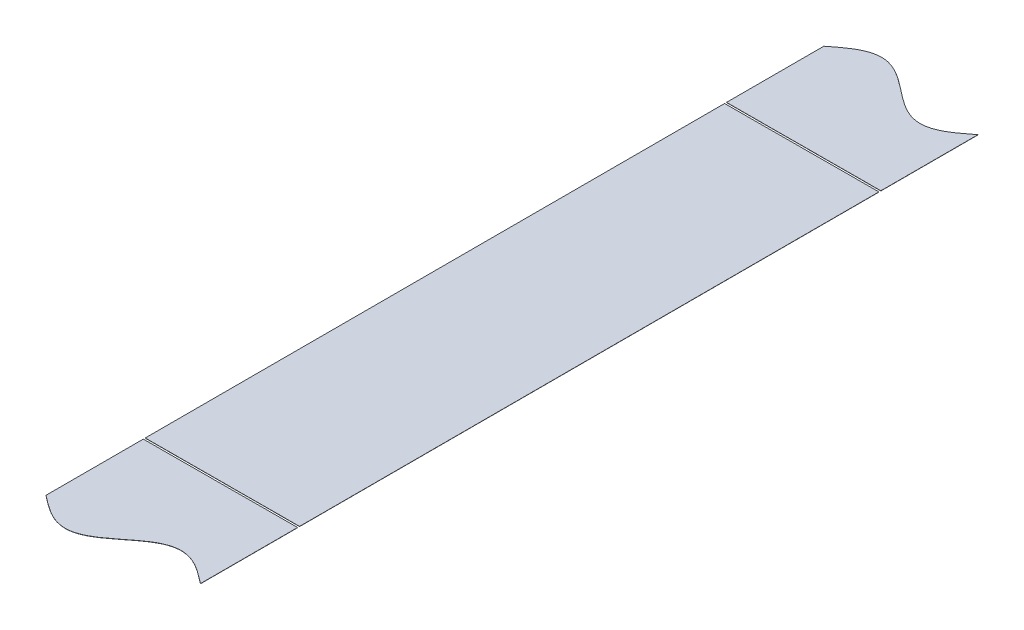
ISO-10303-21;
HEADER;
FILE_DESCRIPTION(('STEP AP214'),'2;1');
FILE_NAME('part.step','',(''),(''),'','','');
FILE_SCHEMA(('AUTOMOTIVE_DESIGN { 1 0 10303 214 1 1 1 1 }'));
ENDSEC;
DATA;
#1=APPLICATION_CONTEXT('core data for automotive mechanical design processes');
#2=APPLICATION_PROTOCOL_DEFINITION('international standard','automotive_design',2000,#1);
#3=PRODUCT_CONTEXT('',#1,'mechanical');
#4=PRODUCT('Part','Part','',(#3));
#5=PRODUCT_RELATED_PRODUCT_CATEGORY('part','',(#4));
#6=PRODUCT_DEFINITION_FORMATION('','',#4);
#7=PRODUCT_DEFINITION_CONTEXT('part definition',#1,'design');
#8=PRODUCT_DEFINITION('design','',#6,#7);
#9=PRODUCT_DEFINITION_SHAPE('','',#8);
#10=(LENGTH_UNIT() NAMED_UNIT(*) SI_UNIT(.MILLI.,.METRE.));
#11=(NAMED_UNIT(*) PLANE_ANGLE_UNIT() SI_UNIT($,.RADIAN.));
#12=(NAMED_UNIT(*) SI_UNIT($,.STERADIAN.) SOLID_ANGLE_UNIT());
#13=UNCERTAINTY_MEASURE_WITH_UNIT(LENGTH_MEASURE(1.E-05),#10,'distance_accuracy_value','');
#14=(GEOMETRIC_REPRESENTATION_CONTEXT(3) GLOBAL_UNCERTAINTY_ASSIGNED_CONTEXT((#13)) GLOBAL_UNIT_ASSIGNED_CONTEXT((#10,
#11,#12)) REPRESENTATION_CONTEXT('',''));
#15=CARTESIAN_POINT('',(0.,0.,0.));
#16=DIRECTION('',(0.,0.,1.));
#17=DIRECTION('',(1.,0.,0.));
#18=AXIS2_PLACEMENT_3D('',#15,#16,#17);
#19=CARTESIAN_POINT('',(-1916.90295724156,44.5239704064109,4200.82368050218));
#20=DIRECTION('',(0.00396825396831522,-0.999992126449225,0.));
#21=DIRECTION('',(0.999992126449225,0.00396825396831522,0.));
#22=AXIS2_PLACEMENT_3D('',#19,#20,#21);
#23=PLANE('',#22);
#24=DIRECTION('',(0.,0.,-1.));
#25=VECTOR('',#24,1.);
#26=CARTESIAN_POINT('',(2083.85,60.4000992067398,200.039222881056));
#27=LINE('',#26,#25);
#28=CARTESIAN_POINT('',(2083.85,60.4000992067398,-150.));
#29=VERTEX_POINT('',#28);
#30=CARTESIAN_POINT('',(2083.85,60.4000992067398,-200.039222881056));
#31=VERTEX_POINT('',#30);
#32=EDGE_CURVE('E58',#29,#31,#27,.T.);
#33=ORIENTED_EDGE('',*,*,#32,.F.);
#34=DIRECTION('',(0.999992126449225,0.00396825396831522,0.));
#35=VECTOR('',#34,1.);
#36=CARTESIAN_POINT('',(-1916.90295724156,44.5239704064109,-150.));
#37=LINE('',#36,#35);
#38=CARTESIAN_POINT('',(2163.23127202954,60.7151067347087,-150.));
#39=VERTEX_POINT('',#38);
#40=EDGE_CURVE('E73',#29,#39,#37,.T.);
#41=ORIENTED_EDGE('',*,*,#40,.T.);
#42=DIRECTION('',(0.,0.,-0.999999999999999));
#43=VECTOR('',#42,1.);
#44=CARTESIAN_POINT('',(2163.23127202953,60.7151067347087,199.960777118944));
#45=LINE('',#44,#43);
#46=CARTESIAN_POINT('',(2163.23127202954,60.7151067347087,-199.960777118944));
#47=VERTEX_POINT('',#46);
#48=EDGE_CURVE('E103',#39,#47,#45,.T.);
#49=ORIENTED_EDGE('',*,*,#48,.T.);
#50=CARTESIAN_POINT('',(2163.23127202954,60.7151067347087,-199.960777118944));
#51=CARTESIAN_POINT('',(2162.83227058531,60.7135233831776,-199.649014553245));
#52=CARTESIAN_POINT('',(2162.61110584181,60.7126457383964,-199.476447141434));
#53=CARTESIAN_POINT('',(2162.26843492665,60.7112859224709,-199.209072550008));
#54=CARTESIAN_POINT('',(2161.66097776661,60.7088753592053,-198.736895640408));
#55=CARTESIAN_POINT('',(2161.04644531362,60.7064367191593,-198.262189428759));
#56=CARTESIAN_POINT('',(2160.42947151086,60.7039883911412,-197.789724739028));
#57=CARTESIAN_POINT('',(2159.81136890345,60.7015355837042,-197.321667982482));
#58=CARTESIAN_POINT('',(2159.19265203401,60.6990803387003,-196.859549525556));
#59=CARTESIAN_POINT('',(2158.57356430056,60.6966236220022,-196.404672498041));
#60=CARTESIAN_POINT('',(2157.62857201002,60.6928736230694,-195.723480697924));
#61=CARTESIAN_POINT('',(2156.39269723694,60.6879693194825,-194.873365928934));
#62=CARTESIAN_POINT('',(2155.15557367569,60.683060060348,-194.071365866634));
#63=CARTESIAN_POINT('',(2153.91770300499,60.6781478364701,-193.325593615003));
#64=CARTESIAN_POINT('',(2152.67935291378,60.6732337101149,-192.643433489053));
#65=CARTESIAN_POINT('',(2151.44068001168,60.6683183027539,-192.031567871962));
#66=CARTESIAN_POINT('',(2150.20178269414,60.6634020048485,-191.49595529888));
#67=CARTESIAN_POINT('',(2148.96272647762,60.6584850763867,-191.041793610318));
#68=CARTESIAN_POINT('',(2147.72355750769,60.6535677004871,-190.673480783868));
#69=CARTESIAN_POINT('',(2146.48431002229,60.6486500130158,-190.394578581034));
#70=CARTESIAN_POINT('',(2145.25130009882,60.6437570779693,-190.208729717805));
#71=CARTESIAN_POINT('',(2144.02447068814,60.6388886689602,-190.115833909474));
#72=CARTESIAN_POINT('',(2143.39852241876,60.6364047276989,-190.115833975178));
#73=CARTESIAN_POINT('',(2142.76634470149,60.6338960662116,-190.116812518519));
#74=CARTESIAN_POINT('',(2141.52701702899,60.6289780605349,-190.213518322697));
#75=CARTESIAN_POINT('',(2140.28771947989,60.6240601743966,-190.404077973196));
#76=CARTESIAN_POINT('',(2139.04847460748,60.6191424972943,-190.686651245001));
#77=CARTESIAN_POINT('',(2137.80930948916,60.6142251366791,-191.058507832992));
#78=CARTESIAN_POINT('',(2136.5702586971,60.609308229743,-191.516051557916));
#79=CARTESIAN_POINT('',(2135.33136901368,60.604391962132,-192.054851382734));
#80=CARTESIAN_POINT('',(2134.09270700731,60.5994765980085,-192.669677937832));
#81=CARTESIAN_POINT('',(2132.85437269486,60.5945625342679,-193.354542833327));
#82=CARTESIAN_POINT('',(2131.61652593999,60.5896504052947,-194.102735047748));
#83=CARTESIAN_POINT('',(2130.37944085323,60.584741298838,-194.906841812199));
#84=CARTESIAN_POINT('',(2129.14363320379,60.5798372616168,-195.758718480029));
#85=CARTESIAN_POINT('',(2128.19849941965,60.5760867011971,-196.441136000885));
#86=CARTESIAN_POINT('',(2127.57943570379,60.5736300798077,-196.896643824806));
#87=CARTESIAN_POINT('',(2126.96075724742,60.5711749872378,-197.359292528751));
#88=CARTESIAN_POINT('',(2126.34272123853,60.5687224440827,-197.827766856771));
#89=CARTESIAN_POINT('',(2125.72587807947,60.566274634496,-198.300507301572));
#90=CARTESIAN_POINT('',(2125.11165965125,60.5638372405898,-198.775253327652));
#91=CARTESIAN_POINT('',(2124.50531593409,60.5614310957832,-199.246752221485));
#92=CARTESIAN_POINT('',(2124.1608022025,60.5600639670365,-199.515619082271));
#93=CARTESIAN_POINT('',(2123.95408994674,60.5592436738487,-199.676942333551));
#94=CARTESIAN_POINT('',(2123.12723370979,60.5559624724704,-200.323017327015));
#95=CARTESIAN_POINT('',(2122.92046982704,60.555141974412,-200.48438091773));
#96=CARTESIAN_POINT('',(2122.57603153038,60.5537751450126,-200.753188988016));
#97=CARTESIAN_POINT('',(2121.969690134,60.5513690094154,-201.224686366466));
#98=CARTESIAN_POINT('',(2121.35547227996,60.5489316177878,-201.699432386551));
#99=CARTESIAN_POINT('',(2120.73862935975,60.5464838091489,-202.17217323462));
#100=CARTESIAN_POINT('',(2120.12059332027,60.5440312658725,-202.640648316153));
#101=CARTESIAN_POINT('',(2119.50191503668,60.5415761739882,-203.103297762819));
#102=CARTESIAN_POINT('',(2118.88285142913,60.5391195530286,-203.558806523883));
#103=CARTESIAN_POINT('',(2117.93771732462,60.5353689913375,-204.241226035762));
#104=CARTESIAN_POINT('',(2116.70190971155,60.5304649542607,-205.093105511873));
#105=CARTESIAN_POINT('',(2115.46482465187,60.5255558479114,-205.897215597009));
#106=CARTESIAN_POINT('',(2114.22697795939,60.5206437191859,-206.645411589792));
#107=CARTESIAN_POINT('',(2112.98864370106,60.5157296556601,-207.330280711682));
#108=CARTESIAN_POINT('',(2111.74998171668,60.5108142916238,-207.945111912896));
#109=CARTESIAN_POINT('',(2110.51109203607,60.5058980240239,-208.483916745192));
#110=CARTESIAN_POINT('',(2109.27204126373,60.5009811171661,-208.941465777346));
#111=CARTESIAN_POINT('',(2108.03287614944,60.4960637565668,-209.313327933492));
#112=CARTESIAN_POINT('',(2106.79363127233,60.491146079446,-209.595906974966));
#113=CARTESIAN_POINT('',(2105.55433373286,60.4862281933458,-209.786472537281));
#114=CARTESIAN_POINT('',(2104.31500606626,60.4813101876926,-209.88318434344));
#115=CARTESIAN_POINT('',(2103.07566835476,60.4763921421784,-209.885108737507));
#116=CARTESIAN_POINT('',(2101.83633990357,60.4714741334117,-209.792227143813));
#117=CARTESIAN_POINT('',(2100.59704073444,60.4665562408446,-209.605436234756));
#118=CARTESIAN_POINT('',(2099.35779324133,60.4616385533427,-209.32653980607));
#119=CARTESIAN_POINT('',(2098.11862428039,60.4567211774788,-208.958232559327));
#120=CARTESIAN_POINT('',(2096.87956806998,60.4518042490412,-208.504076200942));
#121=CARTESIAN_POINT('',(2095.64067073625,60.4468879510716,-207.968468644754));
#122=CARTESIAN_POINT('',(2094.40199780592,60.4419725435986,-207.356607686186));
#123=CARTESIAN_POINT('',(2093.16364767504,60.437058417086,-206.674451812597));
#124=CARTESIAN_POINT('',(2091.92577692899,60.4321461929091,-205.928683351749));
#125=CARTESIAN_POINT('',(2090.6886532791,60.4272369334228,-205.126686589678));
#126=CARTESIAN_POINT('',(2089.45277848636,60.4223326297579,-204.276574658237));
#127=CARTESIAN_POINT('',(2088.50778635337,60.4185826314503,-203.595384748637));
#128=CARTESIAN_POINT('',(2087.88869847999,60.416125914197,-203.140508640699));
#129=CARTESIAN_POINT('',(2087.26998158222,60.4136706690806,-202.678391046074));
#130=CARTESIAN_POINT('',(2086.65187871519,60.4112178606134,-202.210334833082));
#131=CARTESIAN_POINT('',(2086.03490484767,60.4087695323382,-201.737870687313));
#132=CARTESIAN_POINT('',(2085.4203722685,60.4063308917915,-201.263164829315));
#133=CARTESIAN_POINT('',(2084.81291266991,60.403920318849,-200.790986326194));
#134=CARTESIAN_POINT('',(2084.47016618773,60.4025602030521,-200.523552858566));
#135=CARTESIAN_POINT('',(2084.24905217565,60.4016827595876,-200.351025086389));
#136=CARTESIAN_POINT('',(2083.85,60.4000992067398,-200.039222881056));
#137=B_SPLINE_CURVE_WITH_KNOTS('',2,(#50,#51,#52,#53,#54,#55,#56,#57,#58,#59,#60,#61,#62,#63,
#64,#65,#66,#67,#68,#69,#70,#71,#72,#73,#74,#75,#76,#77,#78,#79,#80,#81,#82,#83,#84,#85,#86,#87,
#88,#89,#90,#91,#92,#93,#94,#95,#96,#97,#98,#99,#100,#101,#102,#103,#104,#105,#106,#107,#108,
#109,#110,#111,#112,#113,#114,#115,#116,#117,#118,#119,#120,#121,#122,#123,#124,#125,#126,#127,
#128,#129,#130,#131,#132,#133,#134,#135,#136),.UNSPECIFIED.,.F.,.F.,(3,2,1,1,1,1,1,1,1,1,1,1,1,
1,1,1,1,1,1,1,1,1,1,1,1,1,1,1,1,1,1,1,1,1,1,1,1,1,1,1,2,1,2,1,1,1,1,1,1,1,1,1,1,1,1,1,1,1,1,1,1,
1,1,1,1,1,1,1,1,1,1,1,1,1,1,1,1,1,1,1,2,3),(0.,0.0078125,0.015625,0.0234375,0.03125,0.0390625,
0.046875,0.0546875,0.0625,0.078125,0.09375,0.109375,0.125,0.140625,0.15625,0.171875,0.1875,
0.203125,0.21875,0.234217166900635,0.24968433380127,0.25,0.265625,0.28125,0.296875,0.3125,
0.328125,0.34375,0.359375,0.375,0.390625,0.40625,0.421875,0.4375,0.4453125,0.453125,0.4609375,
0.46875,0.4765625,0.484375,0.4921875,0.5,0.5078125,0.515625,0.5234375,0.53125,0.5390625,
0.546875,0.5546875,0.5625,0.578125,0.59375,0.609375,0.625,0.640625,0.65625,0.671875,0.6875,
0.703125,0.71875,0.734375,0.75,0.765625,0.78125,0.796875,0.8125,0.828125,0.84375,0.859375,0.875,
0.890625,0.90625,0.921875,0.9375,0.9453125,0.953125,0.9609375,0.96875,0.9765625,0.984375,
0.9921875,1.),.UNSPECIFIED.);
#138=EDGE_CURVE('E114',#47,#31,#137,.T.);
#139=ORIENTED_EDGE('',*,*,#138,.T.);
#140=EDGE_LOOP('',(#33,#41,#49,#139));
#141=FACE_BOUND('',#140,.T.);
#142=ADVANCED_FACE('F55',(#141),#23,.F.);
#143=CARTESIAN_POINT('',(-1916.90256041617,44.423971193766,4200.82368050218));
#144=DIRECTION('',(0.00396825396831522,-0.999992126449225,0.));
#145=DIRECTION('',(0.999992126449225,0.00396825396831522,0.));
#146=AXIS2_PLACEMENT_3D('',#143,#144,#145);
#147=PLANE('',#146);
#148=DIRECTION('',(0.999992126449225,0.00396825396831528,0.));
#149=VECTOR('',#148,1.);
#150=CARTESIAN_POINT('',(2083.8503968254,60.3000999940949,-150.));
#151=LINE('',#150,#149);
#152=CARTESIAN_POINT('',(2083.8503968254,60.3000999940949,-150.));
#153=VERTEX_POINT('',#152);
#154=CARTESIAN_POINT('',(2163.23166885493,60.6151075220638,-150.));
#155=VERTEX_POINT('',#154);
#156=EDGE_CURVE('E14',#153,#155,#151,.T.);
#157=ORIENTED_EDGE('',*,*,#156,.F.);
#158=DIRECTION('',(0.,0.,-1.));
#159=VECTOR('',#158,1.);
#160=CARTESIAN_POINT('',(2083.8503968254,60.3000999940949,200.039222881056));
#161=LINE('',#160,#159);
#162=CARTESIAN_POINT('',(2083.8503968254,60.3000999940949,-200.039222881056));
#163=VERTEX_POINT('',#162);
#164=EDGE_CURVE('E104',#153,#163,#161,.T.);
#165=ORIENTED_EDGE('',*,*,#164,.T.);
#166=CARTESIAN_POINT('',(2163.23166885493,60.6151075220638,-199.960777118944));
#167=CARTESIAN_POINT('',(2162.83266741071,60.6135241705327,-199.649014553245));
#168=CARTESIAN_POINT('',(2162.6115026672,60.6126465257515,-199.476447141434));
#169=CARTESIAN_POINT('',(2162.26883175204,60.611286709826,-199.209072550008));
#170=CARTESIAN_POINT('',(2161.661374592,60.6088761465604,-198.736895640408));
#171=CARTESIAN_POINT('',(2161.04684213902,60.6064375065144,-198.262189428759));
#172=CARTESIAN_POINT('',(2160.42986833626,60.6039891784963,-197.789724739028));
#173=CARTESIAN_POINT('',(2159.81176572885,60.6015363710593,-197.321667982482));
#174=CARTESIAN_POINT('',(2159.19304885941,60.5990811260553,-196.859549525556));
#175=CARTESIAN_POINT('',(2158.57396112596,60.5966244093573,-196.404672498041));
#176=CARTESIAN_POINT('',(2157.62896883542,60.5928744104245,-195.723480697924));
#177=CARTESIAN_POINT('',(2156.39309406234,60.5879701068376,-194.873365928934));
#178=CARTESIAN_POINT('',(2155.15597050109,60.5830608477031,-194.071365866634));
#179=CARTESIAN_POINT('',(2153.91809983038,60.5781486238251,-193.325593615003));
#180=CARTESIAN_POINT('',(2152.67974973918,60.5732344974699,-192.643433489053));
#181=CARTESIAN_POINT('',(2151.44107683707,60.568319090109,-192.031567871962));
#182=CARTESIAN_POINT('',(2150.20217951953,60.5634027922036,-191.49595529888));
#183=CARTESIAN_POINT('',(2148.96312330301,60.5584858637418,-191.041793610318));
#184=CARTESIAN_POINT('',(2147.72395433308,60.5535684878422,-190.673480783868));
#185=CARTESIAN_POINT('',(2146.48470684769,60.5486508003709,-190.394578581034));
#186=CARTESIAN_POINT('',(2145.25169692422,60.5437578653244,-190.208729717805));
#187=CARTESIAN_POINT('',(2144.02486751354,60.5388894563153,-190.115833909474));
#188=CARTESIAN_POINT('',(2143.39891924416,60.5364055150539,-190.115833975178));
#189=CARTESIAN_POINT('',(2142.76674152689,60.5338968535666,-190.116812518519));
#190=CARTESIAN_POINT('',(2141.52741385439,60.52897884789,-190.213518322697));
#191=CARTESIAN_POINT('',(2140.28811630528,60.5240609617516,-190.404077973196));
#192=CARTESIAN_POINT('',(2139.04887143288,60.5191432846494,-190.686651245001));
#193=CARTESIAN_POINT('',(2137.80970631455,60.5142259240341,-191.058507832992));
#194=CARTESIAN_POINT('',(2136.5706555225,60.5093090170981,-191.516051557916));
#195=CARTESIAN_POINT('',(2135.33176583907,60.5043927494871,-192.054851382734));
#196=CARTESIAN_POINT('',(2134.09310383271,60.4994773853635,-192.669677937832));
#197=CARTESIAN_POINT('',(2132.85476952026,60.4945633216229,-193.354542833327));
#198=CARTESIAN_POINT('',(2131.61692276538,60.4896511926498,-194.102735047748));
#199=CARTESIAN_POINT('',(2130.37983767863,60.4847420861931,-194.906841812199));
#200=CARTESIAN_POINT('',(2129.14403002919,60.4798380489719,-195.758718480029));
#201=CARTESIAN_POINT('',(2128.19889624505,60.4760874885522,-196.441136000885));
#202=CARTESIAN_POINT('',(2127.57983252918,60.4736308671627,-196.896643824806));
#203=CARTESIAN_POINT('',(2126.96115407281,60.4711757745929,-197.359292528751));
#204=CARTESIAN_POINT('',(2126.34311806393,60.4687232314378,-197.827766856771));
#205=CARTESIAN_POINT('',(2125.72627490487,60.4662754218511,-198.300507301572));
#206=CARTESIAN_POINT('',(2125.11205647664,60.4638380279449,-198.775253327652));
#207=CARTESIAN_POINT('',(2124.50571275949,60.4614318831382,-199.246752221485));
#208=CARTESIAN_POINT('',(2124.16119902789,60.4600647543916,-199.515619082271));
#209=CARTESIAN_POINT('',(2123.95448677214,60.4592444612038,-199.676942333551));
#210=CARTESIAN_POINT('',(2123.12763053519,60.4559632598255,-200.323017327015));
#211=CARTESIAN_POINT('',(2122.92086665243,60.455142761767,-200.48438091773));
#212=CARTESIAN_POINT('',(2122.57642835578,60.4537759323677,-200.753188988016));
#213=CARTESIAN_POINT('',(2121.9700869594,60.4513697967705,-201.224686366466));
#214=CARTESIAN_POINT('',(2121.35586910536,60.4489324051429,-201.699432386551));
#215=CARTESIAN_POINT('',(2120.73902618515,60.446484596504,-202.17217323462));
#216=CARTESIAN_POINT('',(2120.12099014566,60.4440320532275,-202.640648316153));
#217=CARTESIAN_POINT('',(2119.50231186208,60.4415769613433,-203.103297762819));
#218=CARTESIAN_POINT('',(2118.88324825453,60.4391203403837,-203.558806523883));
#219=CARTESIAN_POINT('',(2117.93811415001,60.4353697786926,-204.241226035762));
#220=CARTESIAN_POINT('',(2116.70230653695,60.4304657416158,-205.093105511873));
#221=CARTESIAN_POINT('',(2115.46522147727,60.4255566352665,-205.897215597009));
#222=CARTESIAN_POINT('',(2114.22737478479,60.420644506541,-206.645411589792));
#223=CARTESIAN_POINT('',(2112.98904052646,60.4157304430151,-207.330280711682));
#224=CARTESIAN_POINT('',(2111.75037854207,60.4108150789788,-207.945111912896));
#225=CARTESIAN_POINT('',(2110.51148886147,60.405898811379,-208.483916745192));
#226=CARTESIAN_POINT('',(2109.27243808913,60.4009819045212,-208.941465777346));
#227=CARTESIAN_POINT('',(2108.03327297483,60.3960645439219,-209.313327933492));
#228=CARTESIAN_POINT('',(2106.79402809773,60.391146866801,-209.595906974966));
#229=CARTESIAN_POINT('',(2105.55473055826,60.3862289807009,-209.786472537281));
#230=CARTESIAN_POINT('',(2104.31540289166,60.3813109750477,-209.88318434344));
#231=CARTESIAN_POINT('',(2103.07606518016,60.3763929295335,-209.885108737507));
#232=CARTESIAN_POINT('',(2101.83673672897,60.3714749207668,-209.792227143813));
#233=CARTESIAN_POINT('',(2100.59743755984,60.3665570281997,-209.605436234756));
#234=CARTESIAN_POINT('',(2099.35819006672,60.3616393406978,-209.32653980607));
#235=CARTESIAN_POINT('',(2098.11902110578,60.3567219648339,-208.958232559327));
#236=CARTESIAN_POINT('',(2096.87996489537,60.3518050363963,-208.504076200942));
#237=CARTESIAN_POINT('',(2095.64106756165,60.3468887384267,-207.968468644754));
#238=CARTESIAN_POINT('',(2094.40239463131,60.3419733309537,-207.356607686186));
#239=CARTESIAN_POINT('',(2093.16404450044,60.3370592044411,-206.674451812597));
#240=CARTESIAN_POINT('',(2091.92617375439,60.3321469802641,-205.928683351749));
#241=CARTESIAN_POINT('',(2090.68905010449,60.3272377207778,-205.126686589678));
#242=CARTESIAN_POINT('',(2089.45317531176,60.322333417113,-204.276574658237));
#243=CARTESIAN_POINT('',(2088.50818317876,60.3185834188054,-203.595384748637));
#244=CARTESIAN_POINT('',(2087.88909530539,60.316126701552,-203.140508640699));
#245=CARTESIAN_POINT('',(2087.27037840762,60.3136714564357,-202.678391046074));
#246=CARTESIAN_POINT('',(2086.65227554059,60.3112186479685,-202.210334833082));
#247=CARTESIAN_POINT('',(2086.03530167306,60.3087703196933,-201.737870687313));
#248=CARTESIAN_POINT('',(2085.4207690939,60.3063316791466,-201.263164829315));
#249=CARTESIAN_POINT('',(2084.8133094953,60.3039211062041,-200.790986326194));
#250=CARTESIAN_POINT('',(2084.47056301313,60.3025609904071,-200.523552858566));
#251=CARTESIAN_POINT('',(2084.24944900105,60.3016835469427,-200.351025086389));
#252=CARTESIAN_POINT('',(2083.8503968254,60.3000999940949,-200.039222881056));
#253=B_SPLINE_CURVE_WITH_KNOTS('',2,(#166,#167,#168,#169,#170,#171,#172,#173,#174,#175,#176,
#177,#178,#179,#180,#181,#182,#183,#184,#185,#186,#187,#188,#189,#190,#191,#192,#193,#194,#195,
#196,#197,#198,#199,#200,#201,#202,#203,#204,#205,#206,#207,#208,#209,#210,#211,#212,#213,#214,
#215,#216,#217,#218,#219,#220,#221,#222,#223,#224,#225,#226,#227,#228,#229,#230,#231,#232,#233,
#234,#235,#236,#237,#238,#239,#240,#241,#242,#243,#244,#245,#246,#247,#248,#249,#250,#251,#252),
.UNSPECIFIED.,.F.,.F.,(3,2,1,1,1,1,1,1,1,1,1,1,1,1,1,1,1,1,1,1,1,1,1,1,1,1,1,1,1,1,1,1,1,1,1,1,
1,1,1,1,2,1,2,1,1,1,1,1,1,1,1,1,1,1,1,1,1,1,1,1,1,1,1,1,1,1,1,1,1,1,1,1,1,1,1,1,1,1,1,1,2,3),
(0.,0.0078125,0.015625,0.0234375,0.03125,0.0390625,0.046875,0.0546875,0.0625,0.078125,0.09375,
0.109375,0.125,0.140625,0.15625,0.171875,0.1875,0.203125,0.21875,0.234217166900635,
0.24968433380127,0.25,0.265625,0.28125,0.296875,0.3125,0.328125,0.34375,0.359375,0.375,0.390625,
0.40625,0.421875,0.4375,0.4453125,0.453125,0.4609375,0.46875,0.4765625,0.484375,0.4921875,0.5,
0.5078125,0.515625,0.5234375,0.53125,0.5390625,0.546875,0.5546875,0.5625,0.578125,0.59375,
0.609375,0.625,0.640625,0.65625,0.671875,0.6875,0.703125,0.71875,0.734375,0.75,0.765625,0.78125,
0.796875,0.8125,0.828125,0.84375,0.859375,0.875,0.890625,0.90625,0.921875,0.9375,0.9453125,
0.953125,0.9609375,0.96875,0.9765625,0.984375,0.9921875,1.),.UNSPECIFIED.);
#254=CARTESIAN_POINT('',(2163.23166885493,60.6151075220638,-199.960777118944));
#255=VERTEX_POINT('',#254);
#256=EDGE_CURVE('E109',#255,#163,#253,.T.);
#257=ORIENTED_EDGE('',*,*,#256,.F.);
#258=DIRECTION('',(0.,0.,-0.999999999999999));
#259=VECTOR('',#258,1.);
#260=CARTESIAN_POINT('',(2163.23166885493,60.6151075220637,199.960777118944));
#261=LINE('',#260,#259);
#262=EDGE_CURVE('E101',#155,#255,#261,.T.);
#263=ORIENTED_EDGE('',*,*,#262,.F.);
#264=EDGE_LOOP('',(#157,#165,#257,#263));
#265=FACE_BOUND('',#264,.T.);
#266=ADVANCED_FACE('F107',(#265),#147,.T.);
#267=CARTESIAN_POINT('',(2163.23166885493,60.6151075220637,199.960777118944));
#268=DIRECTION('',(0.999992126449226,0.00396825396824472,0.));
#269=DIRECTION('',(-0.00396825396824472,0.999992126449226,0.));
#270=AXIS2_PLACEMENT_3D('',#267,#268,#269);
#271=PLANE('',#270);
#272=DIRECTION('',(0.00396825396831522,-0.999992126449226,0.));
#273=VECTOR('',#272,1.);
#274=CARTESIAN_POINT('',(2163.19198631525,70.615028786556,-150.));
#275=LINE('',#274,#273);
#276=EDGE_CURVE('E93',#39,#155,#275,.T.);
#277=ORIENTED_EDGE('',*,*,#276,.T.);
#278=ORIENTED_EDGE('',*,*,#262,.T.);
#279=DIRECTION('',(-0.00396825396824473,0.999992126449226,0.));
#280=VECTOR('',#279,1.);
#281=CARTESIAN_POINT('',(2163.23166885493,60.6151075220638,-199.960777118944));
#282=LINE('',#281,#280);
#283=EDGE_CURVE('E110',#255,#47,#282,.T.);
#284=ORIENTED_EDGE('',*,*,#283,.T.);
#285=ORIENTED_EDGE('',*,*,#48,.F.);
#286=EDGE_LOOP('',(#277,#278,#284,#285));
#287=FACE_BOUND('',#286,.T.);
#288=ADVANCED_FACE('F99',(#287),#271,.T.);
#289=CARTESIAN_POINT('',(2083.8503968254,60.3000999940949,200.039222881056));
#290=DIRECTION('',(0.999992126449226,0.00396825396824472,0.));
#291=DIRECTION('',(-0.00396825396824473,0.999992126449226,0.));
#292=AXIS2_PLACEMENT_3D('',#289,#290,#291);
#293=PLANE('',#292);
#294=ORIENTED_EDGE('',*,*,#164,.F.);
#295=DIRECTION('',(-0.00396825396824473,0.999992126449226,0.));
#296=VECTOR('',#295,1.);
#297=CARTESIAN_POINT('',(2083.8503968254,60.3000999940949,-150.));
#298=LINE('',#297,#296);
#299=EDGE_CURVE('E89',#153,#29,#298,.T.);
#300=ORIENTED_EDGE('',*,*,#299,.T.);
#301=ORIENTED_EDGE('',*,*,#32,.T.);
#302=DIRECTION('',(-0.00396825396824473,0.999992126449226,0.));
#303=VECTOR('',#302,1.);
#304=CARTESIAN_POINT('',(2083.8503968254,60.3000999940949,-200.039222881056));
#305=LINE('',#304,#303);
#306=EDGE_CURVE('E64',#163,#31,#305,.T.);
#307=ORIENTED_EDGE('',*,*,#306,.F.);
#308=EDGE_LOOP('',(#294,#300,#301,#307));
#309=FACE_BOUND('',#308,.T.);
#310=ADVANCED_FACE('F133',(#309),#293,.F.);
#311=DIRECTION('',(-0.00396825396824473,0.999992126449226,0.));
#312=VECTOR('',#311,1.);
#313=SURFACE_OF_LINEAR_EXTRUSION('',#253,#312);
#314=ORIENTED_EDGE('',*,*,#138,.F.);
#315=ORIENTED_EDGE('',*,*,#283,.F.);
#316=ORIENTED_EDGE('',*,*,#256,.T.);
#317=ORIENTED_EDGE('',*,*,#306,.T.);
#318=EDGE_LOOP('',(#314,#315,#316,#317));
#319=FACE_BOUND('',#318,.T.);
#320=ADVANCED_FACE('F130',(#319),#313,.T.);
#321=CARTESIAN_POINT('',(2083.81071428572,70.3000212585872,-150.));
#322=DIRECTION('',(0.,0.,-1.));
#323=DIRECTION('',(-1.,0.,0.));
#324=AXIS2_PLACEMENT_3D('',#321,#322,#323);
#325=PLANE('',#324);
#326=ORIENTED_EDGE('',*,*,#299,.F.);
#327=ORIENTED_EDGE('',*,*,#156,.T.);
#328=ORIENTED_EDGE('',*,*,#276,.F.);
#329=ORIENTED_EDGE('',*,*,#40,.F.);
#330=EDGE_LOOP('',(#326,#327,#328,#329));
#331=FACE_BOUND('',#330,.T.);
#332=ADVANCED_FACE('F92',(#331),#325,.F.);
#333=CLOSED_SHELL('',(#142,#266,#288,#310,#320,#332));
#334=MANIFOLD_SOLID_BREP('B2',#333);
#335=CARTESIAN_POINT('',(2083.8503968254,60.3000999940949,200.039222881056));
#336=DIRECTION('',(0.999992126449226,0.00396825396824472,0.));
#337=DIRECTION('',(-0.00396825396824473,0.999992126449226,0.));
#338=AXIS2_PLACEMENT_3D('',#335,#336,#337);
#339=PLANE('',#338);
#340=DIRECTION('',(0.,0.,-1.));
#341=VECTOR('',#340,1.);
#342=CARTESIAN_POINT('',(2083.85,60.4000992067398,200.039222881056));
#343=LINE('',#342,#341);
#344=CARTESIAN_POINT('',(2083.85,60.4000992067398,200.039222881056));
#345=VERTEX_POINT('',#344);
#346=CARTESIAN_POINT('',(2083.85,60.4000992067398,150.));
#347=VERTEX_POINT('',#346);
#348=EDGE_CURVE('E195',#345,#347,#343,.T.);
#349=ORIENTED_EDGE('',*,*,#348,.T.);
#350=DIRECTION('',(0.00396825396831522,-0.999992126449226,0.));
#351=VECTOR('',#350,1.);
#352=CARTESIAN_POINT('',(2083.81071428572,70.3000212585872,150.));
#353=LINE('',#352,#351);
#354=CARTESIAN_POINT('',(2083.8503968254,60.3000999940949,150.));
#355=VERTEX_POINT('',#354);
#356=EDGE_CURVE('E244',#347,#355,#353,.T.);
#357=ORIENTED_EDGE('',*,*,#356,.T.);
#358=DIRECTION('',(0.,0.,-1.));
#359=VECTOR('',#358,1.);
#360=CARTESIAN_POINT('',(2083.8503968254,60.3000999940949,200.039222881056));
#361=LINE('',#360,#359);
#362=CARTESIAN_POINT('',(2083.8503968254,60.3000999940949,200.039222881056));
#363=VERTEX_POINT('',#362);
#364=EDGE_CURVE('E239',#363,#355,#361,.T.);
#365=ORIENTED_EDGE('',*,*,#364,.F.);
#366=DIRECTION('',(-0.00396825396824473,0.999992126449226,0.));
#367=VECTOR('',#366,1.);
#368=CARTESIAN_POINT('',(2083.8503968254,60.3000999940949,200.039222881056));
#369=LINE('',#368,#367);
#370=EDGE_CURVE('E243',#363,#345,#369,.T.);
#371=ORIENTED_EDGE('',*,*,#370,.T.);
#372=EDGE_LOOP('',(#349,#357,#365,#371));
#373=FACE_BOUND('',#372,.T.);
#374=ADVANCED_FACE('F192',(#373),#339,.F.);
#375=CARTESIAN_POINT('',(2163.23166885493,60.6151075220637,199.960777118944));
#376=DIRECTION('',(0.999992126449226,0.00396825396824472,0.));
#377=DIRECTION('',(-0.00396825396824472,0.999992126449226,0.));
#378=AXIS2_PLACEMENT_3D('',#375,#376,#377);
#379=PLANE('',#378);
#380=DIRECTION('',(0.00396825396831522,-0.999992126449226,0.));
#381=VECTOR('',#380,1.);
#382=CARTESIAN_POINT('',(2163.19198631525,70.615028786556,150.));
#383=LINE('',#382,#381);
#384=CARTESIAN_POINT('',(2163.23127202954,60.7151067347087,150.));
#385=VERTEX_POINT('',#384);
#386=CARTESIAN_POINT('',(2163.23166885493,60.6151075220638,150.));
#387=VERTEX_POINT('',#386);
#388=EDGE_CURVE('E201',#385,#387,#383,.T.);
#389=ORIENTED_EDGE('',*,*,#388,.F.);
#390=DIRECTION('',(0.,0.,-0.999999999999999));
#391=VECTOR('',#390,1.);
#392=CARTESIAN_POINT('',(2163.23127202953,60.7151067347087,199.960777118944));
#393=LINE('',#392,#391);
#394=CARTESIAN_POINT('',(2163.23127202953,60.7151067347087,199.960777118944));
#395=VERTEX_POINT('',#394);
#396=EDGE_CURVE('E246',#395,#385,#393,.T.);
#397=ORIENTED_EDGE('',*,*,#396,.F.);
#398=DIRECTION('',(-0.00396825396824473,0.999992126449226,0.));
#399=VECTOR('',#398,1.);
#400=CARTESIAN_POINT('',(2163.23166885493,60.6151075220637,199.960777118944));
#401=LINE('',#400,#399);
#402=CARTESIAN_POINT('',(2163.23166885493,60.6151075220637,199.960777118944));
#403=VERTEX_POINT('',#402);
#404=EDGE_CURVE('E227',#403,#395,#401,.T.);
#405=ORIENTED_EDGE('',*,*,#404,.F.);
#406=DIRECTION('',(0.,0.,-0.999999999999999));
#407=VECTOR('',#406,1.);
#408=CARTESIAN_POINT('',(2163.23166885493,60.6151075220637,199.960777118944));
#409=LINE('',#408,#407);
#410=EDGE_CURVE('E251',#403,#387,#409,.T.);
#411=ORIENTED_EDGE('',*,*,#410,.T.);
#412=EDGE_LOOP('',(#389,#397,#405,#411));
#413=FACE_BOUND('',#412,.T.);
#414=ADVANCED_FACE('F284',(#413),#379,.T.);
#415=CARTESIAN_POINT('',(-1916.90256041617,44.423971193766,4200.82368050218));
#416=DIRECTION('',(0.00396825396831522,-0.999992126449225,0.));
#417=DIRECTION('',(0.999992126449225,0.00396825396831522,0.));
#418=AXIS2_PLACEMENT_3D('',#415,#416,#417);
#419=PLANE('',#418);
#420=DIRECTION('',(-0.999992126449225,-0.00396825396831528,0.));
#421=VECTOR('',#420,1.);
#422=CARTESIAN_POINT('',(2083.8503968254,60.3000999940949,150.));
#423=LINE('',#422,#421);
#424=EDGE_CURVE('E53',#387,#355,#423,.T.);
#425=ORIENTED_EDGE('',*,*,#424,.F.);
#426=ORIENTED_EDGE('',*,*,#410,.F.);
#427=CARTESIAN_POINT('',(2163.23166885493,60.6151075220638,199.960777118944));
#428=CARTESIAN_POINT('',(2162.83266764588,60.6135241714659,199.649014736716));
#429=CARTESIAN_POINT('',(2162.6115026672,60.6126465257515,199.476447141434));
#430=CARTESIAN_POINT('',(2162.26883179473,60.6112867099954,199.209072583351));
#431=CARTESIAN_POINT('',(2161.66137461139,60.6088761466373,198.736895655283));
#432=CARTESIAN_POINT('',(2161.04684210635,60.6064375063848,198.262189403643));
#433=CARTESIAN_POINT('',(2160.429868323,60.6039891784436,197.789724728989));
#434=CARTESIAN_POINT('',(2159.811765736,60.6015363710876,197.321667987894));
#435=CARTESIAN_POINT('',(2159.19304887461,60.5990811261157,196.859549536833));
#436=CARTESIAN_POINT('',(2158.57396113397,60.5966244093891,196.404672503821));
#437=CARTESIAN_POINT('',(2157.62896889136,60.5928744106465,195.723480738248));
#438=CARTESIAN_POINT('',(2156.39309411331,60.5879701070399,194.873365962034));
#439=CARTESIAN_POINT('',(2155.15597050703,60.5830608477266,194.071365870427));
#440=CARTESIAN_POINT('',(2153.91809983469,60.5781486238422,193.325593617377));
#441=CARTESIAN_POINT('',(2152.67974973086,60.5732344974369,192.643433484467));
#442=CARTESIAN_POINT('',(2151.44107683618,60.5683190901055,192.03156787201));
#443=CARTESIAN_POINT('',(2150.20217952354,60.5634027922195,191.495955300174));
#444=CARTESIAN_POINT('',(2148.96312330279,60.5584858637408,191.041793610416));
#445=CARTESIAN_POINT('',(2147.72395433841,60.5535684878633,190.673480785283));
#446=CARTESIAN_POINT('',(2146.48470685153,60.5486508003862,190.39457858168));
#447=CARTESIAN_POINT('',(2145.25169692798,60.5437578653393,190.208729718305));
#448=CARTESIAN_POINT('',(2144.02486751925,60.538889456338,190.115833909691));
#449=CARTESIAN_POINT('',(2143.39891924416,60.5364055150539,190.115833975174));
#450=CARTESIAN_POINT('',(2142.76674152083,60.5338968535426,190.116812518746));
#451=CARTESIAN_POINT('',(2141.52741385405,60.5289788478887,190.213518322968));
#452=CARTESIAN_POINT('',(2140.28811631728,60.5240609617992,190.404077971134));
#453=CARTESIAN_POINT('',(2139.04887144215,60.5191432846862,190.686651242222));
#454=CARTESIAN_POINT('',(2137.809706302,60.5142259239843,191.058507836757));
#455=CARTESIAN_POINT('',(2136.57065552256,60.5093090170984,191.516051558747));
#456=CARTESIAN_POINT('',(2135.33176583531,60.5043927494721,192.054851383529));
#457=CARTESIAN_POINT('',(2134.09310381822,60.499477385306,192.669677946068));
#458=CARTESIAN_POINT('',(2132.8547695201,60.4945633216223,193.354542833197));
#459=CARTESIAN_POINT('',(2131.61692276917,60.4896511926649,194.102735045673));
#460=CARTESIAN_POINT('',(2130.37983768798,60.4847420862302,194.906841805752));
#461=CARTESIAN_POINT('',(2129.1440300361,60.4798380489994,195.758718475265));
#462=CARTESIAN_POINT('',(2128.19889623661,60.4760874885187,196.441136006871));
#463=CARTESIAN_POINT('',(2127.57983250281,60.4736308670581,196.896643844422));
#464=CARTESIAN_POINT('',(2126.9611540649,60.4711757745614,197.359292534768));
#465=CARTESIAN_POINT('',(2126.34311805234,60.4687232313918,197.827766865535));
#466=CARTESIAN_POINT('',(2125.72627490644,60.4662754218573,198.300507300469));
#467=CARTESIAN_POINT('',(2125.11205654816,60.4638380282287,198.77525327227));
#468=CARTESIAN_POINT('',(2124.50571287162,60.4614318835832,199.246752134097));
#469=CARTESIAN_POINT('',(2124.16119902789,60.4600647543916,199.515619082271));
#470=CARTESIAN_POINT('',(2123.95448717214,60.459244462791,199.67694202131));
#471=CARTESIAN_POINT('',(2123.12763021261,60.4559632585454,200.323017578764));
#472=CARTESIAN_POINT('',(2122.92086665243,60.455142761767,200.48438091773));
#473=CARTESIAN_POINT('',(2122.57642828677,60.4537759320938,200.753189041873));
#474=CARTESIAN_POINT('',(2121.97008691135,60.4513697965798,201.224686403595));
#475=CARTESIAN_POINT('',(2121.35586909082,60.4489324050852,201.699432397799));
#476=CARTESIAN_POINT('',(2120.73902618515,60.446484596504,202.172173234502));
#477=CARTESIAN_POINT('',(2120.12099014714,60.4440320532334,202.640648315153));
#478=CARTESIAN_POINT('',(2119.50231185275,60.4415769613063,203.103297769683));
#479=CARTESIAN_POINT('',(2118.88324826229,60.4391203404145,203.558806518171));
#480=CARTESIAN_POINT('',(2117.9381141004,60.4353697784957,204.24122607181));
#481=CARTESIAN_POINT('',(2116.70230653995,60.4304657416277,205.093105507836));
#482=CARTESIAN_POINT('',(2115.46522152478,60.425556635455,205.897215568315));
#483=CARTESIAN_POINT('',(2114.22737478426,60.4206445065389,206.645411590085));
#484=CARTESIAN_POINT('',(2112.98904052228,60.4157304429986,207.330280713993));
#485=CARTESIAN_POINT('',(2111.75037853812,60.4108150789631,207.945111914618));
#486=CARTESIAN_POINT('',(2110.51148885895,60.405898811369,208.483916746288));
#487=CARTESIAN_POINT('',(2109.27243808098,60.4009819044889,208.941465780185));
#488=CARTESIAN_POINT('',(2108.03327296585,60.3960645438862,209.313327935788));
#489=CARTESIAN_POINT('',(2106.79402809702,60.3911468667982,209.595906974878));
#490=CARTESIAN_POINT('',(2105.55473056079,60.3862289807109,209.786472537091));
#491=CARTESIAN_POINT('',(2104.31540289156,60.3813109750473,209.88318434344));
#492=CARTESIAN_POINT('',(2103.07606518301,60.3763929295448,209.885108737502));
#493=CARTESIAN_POINT('',(2101.83673673184,60.3714749207782,209.792227144247));
#494=CARTESIAN_POINT('',(2100.59743755984,60.3665570281997,209.605436234756));
#495=CARTESIAN_POINT('',(2099.35819006368,60.3616393406857,209.326539805385));
#496=CARTESIAN_POINT('',(2098.11902109441,60.3567219647887,208.95823255573));
#497=CARTESIAN_POINT('',(2096.87996488684,60.3518050363624,208.504076197251));
#498=CARTESIAN_POINT('',(2095.64106756954,60.346888738458,207.968468648165));
#499=CARTESIAN_POINT('',(2094.4023946444,60.3419733310056,207.356607693124));
#500=CARTESIAN_POINT('',(2093.16404450121,60.3370592044441,206.674451813287));
#501=CARTESIAN_POINT('',(2091.9261737932,60.3321469804181,205.928683374915));
#502=CARTESIAN_POINT('',(2090.68905014672,60.3272377209454,205.126686618953));
#503=CARTESIAN_POINT('',(2089.45317530736,60.3223334170955,204.276574655001));
#504=CARTESIAN_POINT('',(2088.50818317299,60.3185834187825,203.595384744507));
#505=CARTESIAN_POINT('',(2087.88909529019,60.3161267014917,203.140508629425));
#506=CARTESIAN_POINT('',(2087.27037840048,60.3136714564073,202.678391040666));
#507=CARTESIAN_POINT('',(2086.65227552732,60.3112186479158,202.210334823035));
#508=CARTESIAN_POINT('',(2086.03530165214,60.3087703196103,201.737870671191));
#509=CARTESIAN_POINT('',(2085.42076908729,60.3063316791203,201.263164824182));
#510=CARTESIAN_POINT('',(2084.81330944175,60.3039211059916,200.790986284567));
#511=CARTESIAN_POINT('',(2084.47056301313,60.3025609904071,200.523552858566));
#512=CARTESIAN_POINT('',(2084.24944890704,60.3016835465696,200.351025012936));
#513=CARTESIAN_POINT('',(2083.8503968254,60.3000999940949,200.039222881056));
#514=B_SPLINE_CURVE_WITH_KNOTS('',2,(#427,#428,#429,#430,#431,#432,#433,#434,#435,#436,#437,
#438,#439,#440,#441,#442,#443,#444,#445,#446,#447,#448,#449,#450,#451,#452,#453,#454,#455,#456,
#457,#458,#459,#460,#461,#462,#463,#464,#465,#466,#467,#468,#469,#470,#471,#472,#473,#474,#475,
#476,#477,#478,#479,#480,#481,#482,#483,#484,#485,#486,#487,#488,#489,#490,#491,#492,#493,#494,
#495,#496,#497,#498,#499,#500,#501,#502,#503,#504,#505,#506,#507,#508,#509,#510,#511,#512,#513),
.UNSPECIFIED.,.F.,.F.,(3,2,1,1,1,1,1,1,1,1,1,1,1,1,1,1,1,1,1,1,1,1,1,1,1,1,1,1,1,1,1,1,1,1,1,1,
1,1,1,1,2,1,2,1,1,1,1,1,1,1,1,1,1,1,1,1,1,1,1,1,1,1,1,1,1,1,1,1,1,1,1,1,1,1,1,1,1,1,1,1,2,3),
(0.,0.0078125,0.015625,0.0234375,0.03125,0.0390625,0.046875,0.0546875,0.0625,0.078125,0.09375,
0.109375,0.125,0.140625,0.15625,0.171875,0.1875,0.203125,0.21875,0.234217166900635,
0.24968433380127,0.25,0.265625,0.28125,0.296875,0.3125,0.328125,0.34375,0.359375,0.375,0.390625,
0.40625,0.421875,0.4375,0.4453125,0.453125,0.4609375,0.46875,0.4765625,0.484375,0.4921875,0.5,
0.5078125,0.515625,0.5234375,0.53125,0.5390625,0.546875,0.5546875,0.5625,0.578125,0.59375,
0.609375,0.625,0.640625,0.65625,0.671875,0.6875,0.703125,0.71875,0.734375,0.75,0.765625,0.78125,
0.796875,0.8125,0.828125,0.84375,0.859375,0.875,0.890625,0.90625,0.921875,0.9375,0.9453125,
0.953125,0.9609375,0.96875,0.9765625,0.984375,0.9921875,1.),.UNSPECIFIED.);
#515=EDGE_CURVE('E247',#403,#363,#514,.T.);
#516=ORIENTED_EDGE('',*,*,#515,.T.);
#517=ORIENTED_EDGE('',*,*,#364,.T.);
#518=EDGE_LOOP('',(#425,#426,#516,#517));
#519=FACE_BOUND('',#518,.T.);
#520=ADVANCED_FACE('F250',(#519),#419,.T.);
#521=CARTESIAN_POINT('',(-1916.90295724156,44.5239704064109,4200.82368050218));
#522=DIRECTION('',(0.00396825396831522,-0.999992126449225,0.));
#523=DIRECTION('',(0.999992126449225,0.00396825396831522,0.));
#524=AXIS2_PLACEMENT_3D('',#521,#522,#523);
#525=PLANE('',#524);
#526=ORIENTED_EDGE('',*,*,#396,.T.);
#527=DIRECTION('',(-0.999992126449225,-0.00396825396831522,0.));
#528=VECTOR('',#527,1.);
#529=CARTESIAN_POINT('',(-1916.90295724156,44.5239704064109,150.));
#530=LINE('',#529,#528);
#531=EDGE_CURVE('E210',#385,#347,#530,.T.);
#532=ORIENTED_EDGE('',*,*,#531,.T.);
#533=ORIENTED_EDGE('',*,*,#348,.F.);
#534=CARTESIAN_POINT('',(2163.23127202954,60.7151067347087,199.960777118944));
#535=CARTESIAN_POINT('',(2162.83227082048,60.7135233841109,199.649014736716));
#536=CARTESIAN_POINT('',(2162.6111058418,60.7126457383964,199.476447141434));
#537=CARTESIAN_POINT('',(2162.26843496933,60.7112859226403,199.209072583351));
#538=CARTESIAN_POINT('',(2161.66097778599,60.7088753592823,198.736895655283));
#539=CARTESIAN_POINT('',(2161.04644528096,60.7064367190297,198.262189403643));
#540=CARTESIAN_POINT('',(2160.4294714976,60.7039883910885,197.789724728989));
#541=CARTESIAN_POINT('',(2159.8113689106,60.7015355837325,197.321667987894));
#542=CARTESIAN_POINT('',(2159.19265204921,60.6990803387606,196.859549536833));
#543=CARTESIAN_POINT('',(2158.57356430858,60.696623622034,196.404672503821));
#544=CARTESIAN_POINT('',(2157.62857206596,60.6928736232914,195.723480738248));
#545=CARTESIAN_POINT('',(2156.39269728791,60.6879693196848,194.873365962034));
#546=CARTESIAN_POINT('',(2155.15557368163,60.6830600603716,194.071365870427));
#547=CARTESIAN_POINT('',(2153.9177030093,60.6781478364871,193.325593617377));
#548=CARTESIAN_POINT('',(2152.67935290546,60.6732337100818,192.643433484467));
#549=CARTESIAN_POINT('',(2151.44068001079,60.6683183027504,192.03156787201));
#550=CARTESIAN_POINT('',(2150.20178269815,60.6634020048644,191.495955300174));
#551=CARTESIAN_POINT('',(2148.96272647739,60.6584850763858,191.041793610416));
#552=CARTESIAN_POINT('',(2147.72355751301,60.6535677005082,190.673480785283));
#553=CARTESIAN_POINT('',(2146.48431002614,60.6486500130311,190.39457858168));
#554=CARTESIAN_POINT('',(2145.25130010258,60.6437570779842,190.208729718305));
#555=CARTESIAN_POINT('',(2144.02447069385,60.6388886689829,190.115833909691));
#556=CARTESIAN_POINT('',(2143.39852241876,60.6364047276989,190.115833975174));
#557=CARTESIAN_POINT('',(2142.76634469543,60.6338960661875,190.116812518746));
#558=CARTESIAN_POINT('',(2141.52701702865,60.6289780605336,190.213518322968));
#559=CARTESIAN_POINT('',(2140.28771949188,60.6240601744442,190.404077971134));
#560=CARTESIAN_POINT('',(2139.04847461675,60.6191424973311,190.686651242222));
#561=CARTESIAN_POINT('',(2137.8093094766,60.6142251366292,191.058507836757));
#562=CARTESIAN_POINT('',(2136.57025869717,60.6093082297433,191.516051558747));
#563=CARTESIAN_POINT('',(2135.33136900991,60.6043919621171,192.054851383529));
#564=CARTESIAN_POINT('',(2134.09270699282,60.5994765979509,192.669677946068));
#565=CARTESIAN_POINT('',(2132.85437269471,60.5945625342672,193.354542833197));
#566=CARTESIAN_POINT('',(2131.61652594377,60.5896504053098,194.102735045673));
#567=CARTESIAN_POINT('',(2130.37944086259,60.5847412988751,194.906841805752));
#568=CARTESIAN_POINT('',(2129.1436332107,60.5798372616442,195.758718475265));
#569=CARTESIAN_POINT('',(2128.19849941121,60.5760867011636,196.441136006871));
#570=CARTESIAN_POINT('',(2127.57943567742,60.573630079703,196.896643844422));
#571=CARTESIAN_POINT('',(2126.9607572395,60.5711749872063,197.359292534768));
#572=CARTESIAN_POINT('',(2126.34272122695,60.5687224440367,197.827766865535));
#573=CARTESIAN_POINT('',(2125.72587808104,60.5662746345023,198.300507300469));
#574=CARTESIAN_POINT('',(2125.11165972277,60.5638372408737,198.77525327227));
#575=CARTESIAN_POINT('',(2124.50531604622,60.5614310962281,199.246752134097));
#576=CARTESIAN_POINT('',(2124.1608022025,60.5600639670365,199.515619082271));
#577=CARTESIAN_POINT('',(2123.95409034674,60.559243675436,199.67694202131));
#578=CARTESIAN_POINT('',(2123.12723338721,60.5559624711904,200.323017578764));
#579=CARTESIAN_POINT('',(2122.92046982704,60.555141974412,200.48438091773));
#580=CARTESIAN_POINT('',(2122.57603146137,60.5537751447388,200.753189041873));
#581=CARTESIAN_POINT('',(2121.96969008595,60.5513690092248,201.224686403595));
#582=CARTESIAN_POINT('',(2121.35547226542,60.5489316177301,201.699432397799));
#583=CARTESIAN_POINT('',(2120.73862935976,60.546483809149,202.172173234502));
#584=CARTESIAN_POINT('',(2120.12059332174,60.5440312658783,202.640648315153));
#585=CARTESIAN_POINT('',(2119.50191502735,60.5415761739512,203.103297769683));
#586=CARTESIAN_POINT('',(2118.8828514369,60.5391195530594,203.558806518171));
#587=CARTESIAN_POINT('',(2117.937717275,60.5353689911406,204.24122607181));
#588=CARTESIAN_POINT('',(2116.70190971455,60.5304649542726,205.093105507836));
#589=CARTESIAN_POINT('',(2115.46482469939,60.5255558480999,205.897215568315));
#590=CARTESIAN_POINT('',(2114.22697795887,60.5206437191838,206.645411590085));
#591=CARTESIAN_POINT('',(2112.98864369688,60.5157296556435,207.330280713993));
#592=CARTESIAN_POINT('',(2111.74998171272,60.5108142916081,207.945111914618));
#593=CARTESIAN_POINT('',(2110.51109203355,60.5058980240139,208.483916746288));
#594=CARTESIAN_POINT('',(2109.27204125558,60.5009811171338,208.941465780185));
#595=CARTESIAN_POINT('',(2108.03287614045,60.4960637565312,209.313327935788));
#596=CARTESIAN_POINT('',(2106.79363127162,60.4911460794432,209.595906974878));
#597=CARTESIAN_POINT('',(2105.55433373539,60.4862281933558,209.786472537091));
#598=CARTESIAN_POINT('',(2104.31500606617,60.4813101876922,209.88318434344));
#599=CARTESIAN_POINT('',(2103.07566835762,60.4763921421897,209.885108737502));
#600=CARTESIAN_POINT('',(2101.83633990644,60.4714741334231,209.792227144247));
#601=CARTESIAN_POINT('',(2100.59704073444,60.4665562408446,209.605436234756));
#602=CARTESIAN_POINT('',(2099.35779323828,60.4616385533306,209.326539805385));
#603=CARTESIAN_POINT('',(2098.11862426901,60.4567211774337,208.95823255573));
#604=CARTESIAN_POINT('',(2096.87956806144,60.4518042490073,208.504076197251));
#605=CARTESIAN_POINT('',(2095.64067074414,60.4468879511029,207.968468648165));
#606=CARTESIAN_POINT('',(2094.401997819,60.4419725436505,207.356607693124));
#607=CARTESIAN_POINT('',(2093.16364767581,60.437058417089,206.674451813287));
#608=CARTESIAN_POINT('',(2091.9257769678,60.4321461930631,205.928683374915));
#609=CARTESIAN_POINT('',(2090.68865332133,60.4272369335904,205.126686618953));
#610=CARTESIAN_POINT('',(2089.45277848197,60.4223326297404,204.276574655001));
#611=CARTESIAN_POINT('',(2088.50778634759,60.4185826314274,203.595384744507));
#612=CARTESIAN_POINT('',(2087.88869846479,60.4161259141366,203.140508629425));
#613=CARTESIAN_POINT('',(2087.26998157508,60.4136706690523,202.678391040666));
#614=CARTESIAN_POINT('',(2086.65187870193,60.4112178605607,202.210334823035));
#615=CARTESIAN_POINT('',(2086.03490482675,60.4087695322552,201.737870671191));
#616=CARTESIAN_POINT('',(2085.42037226189,60.4063308917653,201.263164824182));
#617=CARTESIAN_POINT('',(2084.81291261635,60.4039203186365,200.790986284567));
#618=CARTESIAN_POINT('',(2084.47016618773,60.4025602030521,200.523552858566));
#619=CARTESIAN_POINT('',(2084.24905208165,60.4016827592145,200.351025012936));
#620=CARTESIAN_POINT('',(2083.85,60.4000992067398,200.039222881056));
#621=B_SPLINE_CURVE_WITH_KNOTS('',2,(#534,#535,#536,#537,#538,#539,#540,#541,#542,#543,#544,
#545,#546,#547,#548,#549,#550,#551,#552,#553,#554,#555,#556,#557,#558,#559,#560,#561,#562,#563,
#564,#565,#566,#567,#568,#569,#570,#571,#572,#573,#574,#575,#576,#577,#578,#579,#580,#581,#582,
#583,#584,#585,#586,#587,#588,#589,#590,#591,#592,#593,#594,#595,#596,#597,#598,#599,#600,#601,
#602,#603,#604,#605,#606,#607,#608,#609,#610,#611,#612,#613,#614,#615,#616,#617,#618,#619,#620),
.UNSPECIFIED.,.F.,.F.,(3,2,1,1,1,1,1,1,1,1,1,1,1,1,1,1,1,1,1,1,1,1,1,1,1,1,1,1,1,1,1,1,1,1,1,1,
1,1,1,1,2,1,2,1,1,1,1,1,1,1,1,1,1,1,1,1,1,1,1,1,1,1,1,1,1,1,1,1,1,1,1,1,1,1,1,1,1,1,1,1,2,3),
(0.,0.0078125,0.015625,0.0234375,0.03125,0.0390625,0.046875,0.0546875,0.0625,0.078125,0.09375,
0.109375,0.125,0.140625,0.15625,0.171875,0.1875,0.203125,0.21875,0.234217166900635,
0.24968433380127,0.25,0.265625,0.28125,0.296875,0.3125,0.328125,0.34375,0.359375,0.375,0.390625,
0.40625,0.421875,0.4375,0.4453125,0.453125,0.4609375,0.46875,0.4765625,0.484375,0.4921875,0.5,
0.5078125,0.515625,0.5234375,0.53125,0.5390625,0.546875,0.5546875,0.5625,0.578125,0.59375,
0.609375,0.625,0.640625,0.65625,0.671875,0.6875,0.703125,0.71875,0.734375,0.75,0.765625,0.78125,
0.796875,0.8125,0.828125,0.84375,0.859375,0.875,0.890625,0.90625,0.921875,0.9375,0.9453125,
0.953125,0.9609375,0.96875,0.9765625,0.984375,0.9921875,1.),.UNSPECIFIED.);
#622=EDGE_CURVE('E254',#395,#345,#621,.T.);
#623=ORIENTED_EDGE('',*,*,#622,.F.);
#624=EDGE_LOOP('',(#526,#532,#533,#623));
#625=FACE_BOUND('',#624,.T.);
#626=ADVANCED_FACE('F277',(#625),#525,.F.);
#627=DIRECTION('',(-0.00396825396824473,0.999992126449226,0.));
#628=VECTOR('',#627,1.);
#629=SURFACE_OF_LINEAR_EXTRUSION('',#514,#628);
#630=ORIENTED_EDGE('',*,*,#622,.T.);
#631=ORIENTED_EDGE('',*,*,#370,.F.);
#632=ORIENTED_EDGE('',*,*,#515,.F.);
#633=ORIENTED_EDGE('',*,*,#404,.T.);
#634=EDGE_LOOP('',(#630,#631,#632,#633));
#635=FACE_BOUND('',#634,.T.);
#636=ADVANCED_FACE('F253',(#635),#629,.F.);
#637=CARTESIAN_POINT('',(2083.81071428572,70.3000212585872,150.));
#638=DIRECTION('',(0.,0.,1.));
#639=DIRECTION('',(1.,0.,0.));
#640=AXIS2_PLACEMENT_3D('',#637,#638,#639);
#641=PLANE('',#640);
#642=ORIENTED_EDGE('',*,*,#388,.T.);
#643=ORIENTED_EDGE('',*,*,#424,.T.);
#644=ORIENTED_EDGE('',*,*,#356,.F.);
#645=ORIENTED_EDGE('',*,*,#531,.F.);
#646=EDGE_LOOP('',(#642,#643,#644,#645));
#647=FACE_BOUND('',#646,.T.);
#648=ADVANCED_FACE('F276',(#647),#641,.F.);
#649=CLOSED_SHELL('',(#374,#414,#520,#626,#636,#648));
#650=MANIFOLD_SOLID_BREP('B8',#649);
#651=CARTESIAN_POINT('',(2083.81071428572,70.3000212585872,149.));
#652=DIRECTION('',(0.,0.,-1.));
#653=DIRECTION('',(-1.,0.,0.));
#654=AXIS2_PLACEMENT_3D('',#651,#652,#653);
#655=PLANE('',#654);
#656=DIRECTION('',(0.00396825396831522,-0.999992126449226,0.));
#657=VECTOR('',#656,1.);
#658=CARTESIAN_POINT('',(2083.81071428572,70.3000212585872,149.));
#659=LINE('',#658,#657);
#660=CARTESIAN_POINT('',(2083.85,60.4000992067398,149.));
#661=VERTEX_POINT('',#660);
#662=CARTESIAN_POINT('',(2083.8503968254,60.3000999940949,149.));
#663=VERTEX_POINT('',#662);
#664=EDGE_CURVE('E389',#661,#663,#659,.T.);
#665=ORIENTED_EDGE('',*,*,#664,.T.);
#666=DIRECTION('',(0.999992126449225,0.00396825396831528,0.));
#667=VECTOR('',#666,1.);
#668=CARTESIAN_POINT('',(2083.8503968254,60.3000999940949,149.));
#669=LINE('',#668,#667);
#670=CARTESIAN_POINT('',(2163.23166885493,60.6151075220638,149.));
#671=VERTEX_POINT('',#670);
#672=EDGE_CURVE('E391',#663,#671,#669,.T.);
#673=ORIENTED_EDGE('',*,*,#672,.T.);
#674=DIRECTION('',(0.00396825396831522,-0.999992126449226,0.));
#675=VECTOR('',#674,1.);
#676=CARTESIAN_POINT('',(2163.19198631525,70.615028786556,149.));
#677=LINE('',#676,#675);
#678=CARTESIAN_POINT('',(2163.23127202954,60.7151067347087,149.));
#679=VERTEX_POINT('',#678);
#680=EDGE_CURVE('E342',#679,#671,#677,.T.);
#681=ORIENTED_EDGE('',*,*,#680,.F.);
#682=DIRECTION('',(0.999992126449225,0.00396825396831522,0.));
#683=VECTOR('',#682,1.);
#684=CARTESIAN_POINT('',(-1916.90295724156,44.5239704064109,149.));
#685=LINE('',#684,#683);
#686=EDGE_CURVE('E328',#661,#679,#685,.T.);
#687=ORIENTED_EDGE('',*,*,#686,.F.);
#688=EDGE_LOOP('',(#665,#673,#681,#687));
#689=FACE_BOUND('',#688,.T.);
#690=ADVANCED_FACE('F320',(#689),#655,.F.);
#691=CARTESIAN_POINT('',(2083.8503968254,60.3000999940949,200.039222881056));
#692=DIRECTION('',(0.999992126449226,0.00396825396824472,0.));
#693=DIRECTION('',(-0.00396825396824473,0.999992126449226,0.));
#694=AXIS2_PLACEMENT_3D('',#691,#692,#693);
#695=PLANE('',#694);
#696=DIRECTION('',(0.,0.,-1.));
#697=VECTOR('',#696,1.);
#698=CARTESIAN_POINT('',(2083.85,60.4000992067398,200.039222881056));
#699=LINE('',#698,#697);
#700=CARTESIAN_POINT('',(2083.85,60.4000992067398,-149.));
#701=VERTEX_POINT('',#700);
#702=EDGE_CURVE('E382',#661,#701,#699,.T.);
#703=ORIENTED_EDGE('',*,*,#702,.T.);
#704=DIRECTION('',(0.00396825396824473,-0.999992126449226,0.));
#705=VECTOR('',#704,1.);
#706=CARTESIAN_POINT('',(2083.8503968254,60.3000999940949,-149.));
#707=LINE('',#706,#705);
#708=CARTESIAN_POINT('',(2083.8503968254,60.3000999940949,-149.));
#709=VERTEX_POINT('',#708);
#710=EDGE_CURVE('E190',#701,#709,#707,.T.);
#711=ORIENTED_EDGE('',*,*,#710,.T.);
#712=DIRECTION('',(0.,0.,-1.));
#713=VECTOR('',#712,1.);
#714=CARTESIAN_POINT('',(2083.8503968254,60.3000999940949,200.039222881056));
#715=LINE('',#714,#713);
#716=EDGE_CURVE('E374',#663,#709,#715,.T.);
#717=ORIENTED_EDGE('',*,*,#716,.F.);
#718=ORIENTED_EDGE('',*,*,#664,.F.);
#719=EDGE_LOOP('',(#703,#711,#717,#718));
#720=FACE_BOUND('',#719,.T.);
#721=ADVANCED_FACE('F322',(#720),#695,.F.);
#722=CARTESIAN_POINT('',(2163.23166885493,60.6151075220637,199.960777118944));
#723=DIRECTION('',(0.999992126449226,0.00396825396824472,0.));
#724=DIRECTION('',(-0.00396825396824472,0.999992126449226,0.));
#725=AXIS2_PLACEMENT_3D('',#722,#723,#724);
#726=PLANE('',#725);
#727=DIRECTION('',(0.00396825396831522,-0.999992126449226,0.));
#728=VECTOR('',#727,1.);
#729=CARTESIAN_POINT('',(2163.19198631525,70.615028786556,-149.));
#730=LINE('',#729,#728);
#731=CARTESIAN_POINT('',(2163.23127202954,60.7151067347087,-149.));
#732=VERTEX_POINT('',#731);
#733=CARTESIAN_POINT('',(2163.23166885493,60.6151075220638,-149.));
#734=VERTEX_POINT('',#733);
#735=EDGE_CURVE('E358',#732,#734,#730,.T.);
#736=ORIENTED_EDGE('',*,*,#735,.F.);
#737=DIRECTION('',(0.,0.,-0.999999999999999));
#738=VECTOR('',#737,1.);
#739=CARTESIAN_POINT('',(2163.23127202953,60.7151067347087,199.960777118944));
#740=LINE('',#739,#738);
#741=EDGE_CURVE('E378',#679,#732,#740,.T.);
#742=ORIENTED_EDGE('',*,*,#741,.F.);
#743=ORIENTED_EDGE('',*,*,#680,.T.);
#744=DIRECTION('',(0.,0.,-0.999999999999999));
#745=VECTOR('',#744,1.);
#746=CARTESIAN_POINT('',(2163.23166885493,60.6151075220637,199.960777118944));
#747=LINE('',#746,#745);
#748=EDGE_CURVE('E372',#671,#734,#747,.T.);
#749=ORIENTED_EDGE('',*,*,#748,.T.);
#750=EDGE_LOOP('',(#736,#742,#743,#749));
#751=FACE_BOUND('',#750,.T.);
#752=ADVANCED_FACE('F376',(#751),#726,.T.);
#753=CARTESIAN_POINT('',(-1916.90256041617,44.423971193766,4200.82368050218));
#754=DIRECTION('',(0.00396825396831522,-0.999992126449225,0.));
#755=DIRECTION('',(0.999992126449225,0.00396825396831522,0.));
#756=AXIS2_PLACEMENT_3D('',#753,#754,#755);
#757=PLANE('',#756);
#758=DIRECTION('',(-0.999992126449225,-0.00396825396831528,0.));
#759=VECTOR('',#758,1.);
#760=CARTESIAN_POINT('',(2083.8503968254,60.3000999940949,-149.));
#761=LINE('',#760,#759);
#762=EDGE_CURVE('E335',#734,#709,#761,.T.);
#763=ORIENTED_EDGE('',*,*,#762,.F.);
#764=ORIENTED_EDGE('',*,*,#748,.F.);
#765=ORIENTED_EDGE('',*,*,#672,.F.);
#766=ORIENTED_EDGE('',*,*,#716,.T.);
#767=EDGE_LOOP('',(#763,#764,#765,#766));
#768=FACE_BOUND('',#767,.T.);
#769=ADVANCED_FACE('F370',(#768),#757,.T.);
#770=CARTESIAN_POINT('',(-1916.90295724156,44.5239704064109,4200.82368050218));
#771=DIRECTION('',(0.00396825396831522,-0.999992126449225,0.));
#772=DIRECTION('',(0.999992126449225,0.00396825396831522,0.));
#773=AXIS2_PLACEMENT_3D('',#770,#771,#772);
#774=PLANE('',#773);
#775=ORIENTED_EDGE('',*,*,#741,.T.);
#776=DIRECTION('',(-0.999992126449225,-0.00396825396831522,0.));
#777=VECTOR('',#776,1.);
#778=CARTESIAN_POINT('',(-1916.90295724156,44.5239704064109,-149.));
#779=LINE('',#778,#777);
#780=EDGE_CURVE('E361',#732,#701,#779,.T.);
#781=ORIENTED_EDGE('',*,*,#780,.T.);
#782=ORIENTED_EDGE('',*,*,#702,.F.);
#783=ORIENTED_EDGE('',*,*,#686,.T.);
#784=EDGE_LOOP('',(#775,#781,#782,#783));
#785=FACE_BOUND('',#784,.T.);
#786=ADVANCED_FACE('F386',(#785),#774,.F.);
#787=CARTESIAN_POINT('',(2083.81071428572,70.3000212585872,-149.));
#788=DIRECTION('',(0.,0.,1.));
#789=DIRECTION('',(1.,0.,0.));
#790=AXIS2_PLACEMENT_3D('',#787,#788,#789);
#791=PLANE('',#790);
#792=ORIENTED_EDGE('',*,*,#735,.T.);
#793=ORIENTED_EDGE('',*,*,#762,.T.);
#794=ORIENTED_EDGE('',*,*,#710,.F.);
#795=ORIENTED_EDGE('',*,*,#780,.F.);
#796=EDGE_LOOP('',(#792,#793,#794,#795));
#797=FACE_BOUND('',#796,.T.);
#798=ADVANCED_FACE('F359',(#797),#791,.F.);
#799=CLOSED_SHELL('',(#690,#721,#752,#769,#786,#798));
#800=MANIFOLD_SOLID_BREP('B47',#799);
#801=ADVANCED_BREP_SHAPE_REPRESENTATION('',(#18,#334,#650,#800),#14);
#802=SHAPE_DEFINITION_REPRESENTATION(#9,#801);
ENDSEC;
END-ISO-10303-21;
